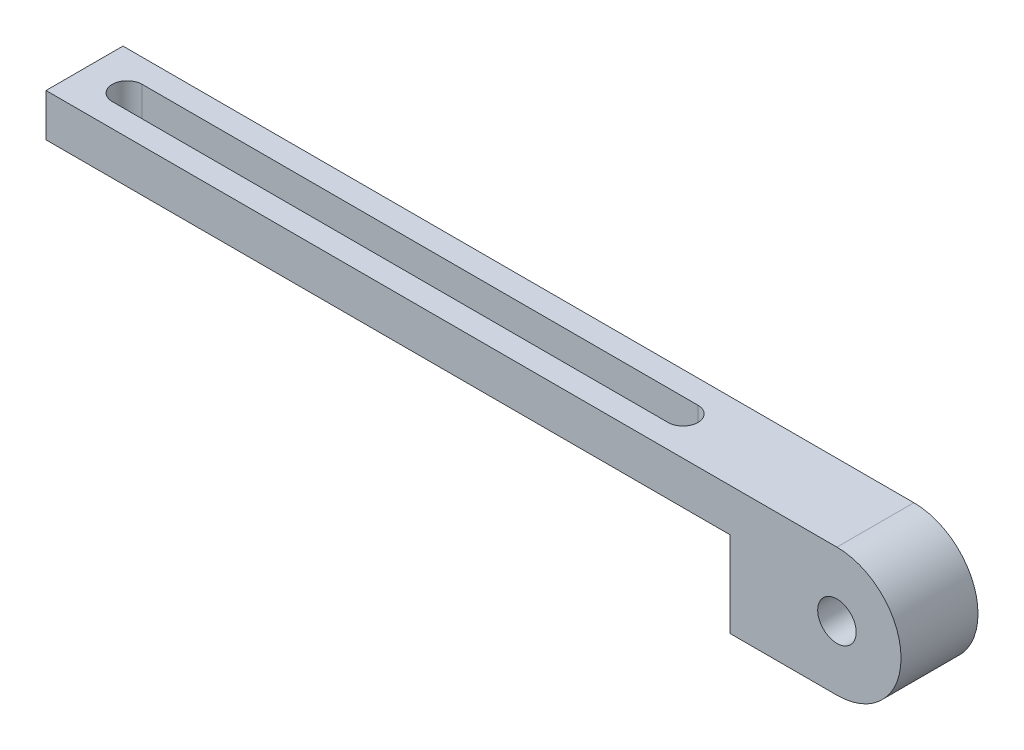
ISO-10303-21;
HEADER;
FILE_DESCRIPTION(('STEP AP214'),'2;1');
FILE_NAME('part.step','',(''),(''),'','','');
FILE_SCHEMA(('AUTOMOTIVE_DESIGN { 1 0 10303 214 1 1 1 1 }'));
ENDSEC;
DATA;
#1=APPLICATION_CONTEXT('core data for automotive mechanical design processes');
#2=APPLICATION_PROTOCOL_DEFINITION('international standard','automotive_design',2000,#1);
#3=PRODUCT_CONTEXT('',#1,'mechanical');
#4=PRODUCT('Part','Part','',(#3));
#5=PRODUCT_RELATED_PRODUCT_CATEGORY('part','',(#4));
#6=PRODUCT_DEFINITION_FORMATION('','',#4);
#7=PRODUCT_DEFINITION_CONTEXT('part definition',#1,'design');
#8=PRODUCT_DEFINITION('design','',#6,#7);
#9=PRODUCT_DEFINITION_SHAPE('','',#8);
#10=(LENGTH_UNIT() NAMED_UNIT(*) SI_UNIT(.MILLI.,.METRE.));
#11=(NAMED_UNIT(*) PLANE_ANGLE_UNIT() SI_UNIT($,.RADIAN.));
#12=(NAMED_UNIT(*) SI_UNIT($,.STERADIAN.) SOLID_ANGLE_UNIT());
#13=UNCERTAINTY_MEASURE_WITH_UNIT(LENGTH_MEASURE(1.E-05),#10,'distance_accuracy_value','');
#14=(GEOMETRIC_REPRESENTATION_CONTEXT(3) GLOBAL_UNCERTAINTY_ASSIGNED_CONTEXT((#13)) GLOBAL_UNIT_ASSIGNED_CONTEXT((#10,
#11,#12)) REPRESENTATION_CONTEXT('',''));
#15=CARTESIAN_POINT('',(0.,0.,0.));
#16=DIRECTION('',(0.,0.,1.));
#17=DIRECTION('',(1.,0.,0.));
#18=AXIS2_PLACEMENT_3D('',#15,#16,#17);
#19=CARTESIAN_POINT('',(0.,5.,0.));
#20=DIRECTION('',(0.,0.,-1.));
#21=DIRECTION('',(-1.,0.,0.));
#22=AXIS2_PLACEMENT_3D('',#19,#20,#21);
#23=PLANE('',#22);
#24=DIRECTION('',(1.,0.,0.));
#25=VECTOR('',#24,1.);
#26=CARTESIAN_POINT('',(100.,-10.,0.));
#27=LINE('',#26,#25);
#28=CARTESIAN_POINT('',(80.,-10.,0.));
#29=VERTEX_POINT('',#28);
#30=CARTESIAN_POINT('',(92.5,-10.,0.));
#31=VERTEX_POINT('',#30);
#32=EDGE_CURVE('E229',#29,#31,#27,.T.);
#33=ORIENTED_EDGE('',*,*,#32,.T.);
#34=CARTESIAN_POINT('',(92.5,-2.5,0.));
#35=DIRECTION('',(0.,0.,-1.));
#36=DIRECTION('',(-1.,0.,0.));
#37=AXIS2_PLACEMENT_3D('',#34,#35,#36);
#38=CIRCLE('',#37,7.5);
#39=CARTESIAN_POINT('',(92.5,5.,0.));
#40=VERTEX_POINT('',#39);
#41=EDGE_CURVE('E205',#31,#40,#38,.F.);
#42=ORIENTED_EDGE('',*,*,#41,.T.);
#43=DIRECTION('',(1.,0.,0.));
#44=VECTOR('',#43,1.);
#45=CARTESIAN_POINT('',(0.,5.,0.));
#46=LINE('',#45,#44);
#47=CARTESIAN_POINT('',(0.,5.,0.));
#48=VERTEX_POINT('',#47);
#49=EDGE_CURVE('E279',#48,#40,#46,.T.);
#50=ORIENTED_EDGE('',*,*,#49,.F.);
#51=DIRECTION('',(0.,-1.,0.));
#52=VECTOR('',#51,1.);
#53=CARTESIAN_POINT('',(0.,5.,0.));
#54=LINE('',#53,#52);
#55=CARTESIAN_POINT('',(0.,0.,0.));
#56=VERTEX_POINT('',#55);
#57=EDGE_CURVE('E299',#48,#56,#54,.T.);
#58=ORIENTED_EDGE('',*,*,#57,.T.);
#59=DIRECTION('',(1.,0.,0.));
#60=VECTOR('',#59,1.);
#61=CARTESIAN_POINT('',(0.,0.,0.));
#62=LINE('',#61,#60);
#63=CARTESIAN_POINT('',(80.,0.,0.));
#64=VERTEX_POINT('',#63);
#65=EDGE_CURVE('E290',#56,#64,#62,.T.);
#66=ORIENTED_EDGE('',*,*,#65,.T.);
#67=DIRECTION('',(0.,-1.,0.));
#68=VECTOR('',#67,1.);
#69=CARTESIAN_POINT('',(80.,5.,0.));
#70=LINE('',#69,#68);
#71=EDGE_CURVE('E225',#64,#29,#70,.T.);
#72=ORIENTED_EDGE('',*,*,#71,.T.);
#73=EDGE_LOOP('',(#33,#42,#50,#58,#66,#72));
#74=FACE_BOUND('',#73,.T.);
#75=CARTESIAN_POINT('',(92.5,-2.5,0.));
#76=DIRECTION('',(0.,0.,-1.));
#77=DIRECTION('',(-1.,0.,0.));
#78=AXIS2_PLACEMENT_3D('',#75,#76,#77);
#79=CIRCLE('',#78,2.25);
#80=CARTESIAN_POINT('',(90.25,-2.5,0.));
#81=VERTEX_POINT('',#80);
#82=EDGE_CURVE('E206',#81,#81,#79,.T.);
#83=ORIENTED_EDGE('',*,*,#82,.T.);
#84=EDGE_LOOP('',(#83));
#85=FACE_BOUND('',#84,.T.);
#86=ADVANCED_FACE('F119',(#74,#85),#23,.F.);
#87=CARTESIAN_POINT('',(0.,5.,-9.));
#88=DIRECTION('',(0.,0.,1.));
#89=DIRECTION('',(1.,0.,0.));
#90=AXIS2_PLACEMENT_3D('',#87,#88,#89);
#91=PLANE('',#90);
#92=CARTESIAN_POINT('',(92.5,-2.5,-9.));
#93=DIRECTION('',(0.,0.,-1.));
#94=DIRECTION('',(-1.,0.,0.));
#95=AXIS2_PLACEMENT_3D('',#92,#93,#94);
#96=CIRCLE('',#95,7.5);
#97=CARTESIAN_POINT('',(92.5,-10.,-9.));
#98=VERTEX_POINT('',#97);
#99=CARTESIAN_POINT('',(92.5,5.,-9.));
#100=VERTEX_POINT('',#99);
#101=EDGE_CURVE('E135',#98,#100,#96,.F.);
#102=ORIENTED_EDGE('',*,*,#101,.F.);
#103=DIRECTION('',(-1.,0.,0.));
#104=VECTOR('',#103,1.);
#105=CARTESIAN_POINT('',(100.,-10.,-9.));
#106=LINE('',#105,#104);
#107=CARTESIAN_POINT('',(80.,-10.,-9.));
#108=VERTEX_POINT('',#107);
#109=EDGE_CURVE('E200',#98,#108,#106,.T.);
#110=ORIENTED_EDGE('',*,*,#109,.T.);
#111=DIRECTION('',(0.,1.,0.));
#112=VECTOR('',#111,1.);
#113=CARTESIAN_POINT('',(80.,5.,-9.));
#114=LINE('',#113,#112);
#115=CARTESIAN_POINT('',(80.,0.,-9.));
#116=VERTEX_POINT('',#115);
#117=EDGE_CURVE('E218',#108,#116,#114,.T.);
#118=ORIENTED_EDGE('',*,*,#117,.T.);
#119=DIRECTION('',(-1.,0.,0.));
#120=VECTOR('',#119,1.);
#121=CARTESIAN_POINT('',(0.,0.,-9.));
#122=LINE('',#121,#120);
#123=CARTESIAN_POINT('',(0.,0.,-9.));
#124=VERTEX_POINT('',#123);
#125=EDGE_CURVE('E280',#116,#124,#122,.T.);
#126=ORIENTED_EDGE('',*,*,#125,.T.);
#127=DIRECTION('',(0.,-1.,0.));
#128=VECTOR('',#127,1.);
#129=CARTESIAN_POINT('',(0.,5.,-9.));
#130=LINE('',#129,#128);
#131=CARTESIAN_POINT('',(0.,5.,-9.));
#132=VERTEX_POINT('',#131);
#133=EDGE_CURVE('E286',#132,#124,#130,.T.);
#134=ORIENTED_EDGE('',*,*,#133,.F.);
#135=DIRECTION('',(-1.,0.,0.));
#136=VECTOR('',#135,1.);
#137=CARTESIAN_POINT('',(0.,5.,-9.));
#138=LINE('',#137,#136);
#139=EDGE_CURVE('E203',#100,#132,#138,.T.);
#140=ORIENTED_EDGE('',*,*,#139,.F.);
#141=EDGE_LOOP('',(#102,#110,#118,#126,#134,#140));
#142=FACE_BOUND('',#141,.T.);
#143=CARTESIAN_POINT('',(92.5,-2.5,-9.));
#144=DIRECTION('',(0.,0.,-1.));
#145=DIRECTION('',(-1.,0.,0.));
#146=AXIS2_PLACEMENT_3D('',#143,#144,#145);
#147=CIRCLE('',#146,2.25);
#148=CARTESIAN_POINT('',(90.25,-2.5,-9.));
#149=VERTEX_POINT('',#148);
#150=EDGE_CURVE('E393',#149,#149,#147,.T.);
#151=ORIENTED_EDGE('',*,*,#150,.F.);
#152=EDGE_LOOP('',(#151));
#153=FACE_BOUND('',#152,.T.);
#154=ADVANCED_FACE('F196',(#142,#153),#91,.F.);
#155=CARTESIAN_POINT('',(100.,-10.,25.));
#156=DIRECTION('',(0.,-1.,0.));
#157=DIRECTION('',(0.,0.,-1.));
#158=AXIS2_PLACEMENT_3D('',#155,#156,#157);
#159=PLANE('',#158);
#160=ORIENTED_EDGE('',*,*,#109,.F.);
#161=DIRECTION('',(0.,0.,-1.));
#162=VECTOR('',#161,1.);
#163=CARTESIAN_POINT('',(92.5,-10.,1.));
#164=LINE('',#163,#162);
#165=EDGE_CURVE('E12',#98,#31,#164,.F.);
#166=ORIENTED_EDGE('',*,*,#165,.T.);
#167=ORIENTED_EDGE('',*,*,#32,.F.);
#168=DIRECTION('',(0.,0.,-1.));
#169=VECTOR('',#168,1.);
#170=CARTESIAN_POINT('',(80.,-10.,25.));
#171=LINE('',#170,#169);
#172=EDGE_CURVE('E215',#29,#108,#171,.T.);
#173=ORIENTED_EDGE('',*,*,#172,.T.);
#174=EDGE_LOOP('',(#160,#166,#167,#173));
#175=FACE_BOUND('',#174,.T.);
#176=ADVANCED_FACE('F213',(#175),#159,.T.);
#177=CARTESIAN_POINT('',(0.,5.,0.));
#178=DIRECTION('',(0.,-1.,0.));
#179=DIRECTION('',(0.,0.,-1.));
#180=AXIS2_PLACEMENT_3D('',#177,#178,#179);
#181=PLANE('',#180);
#182=DIRECTION('',(1.,0.,0.));
#183=VECTOR('',#182,1.);
#184=CARTESIAN_POINT('',(5.,5.,-2.75));
#185=LINE('',#184,#183);
#186=CARTESIAN_POINT('',(5.,5.,-2.75));
#187=VERTEX_POINT('',#186);
#188=CARTESIAN_POINT('',(70.,5.,-2.75));
#189=VERTEX_POINT('',#188);
#190=EDGE_CURVE('E252',#187,#189,#185,.T.);
#191=ORIENTED_EDGE('',*,*,#190,.F.);
#192=CARTESIAN_POINT('',(5.,5.,-4.5));
#193=DIRECTION('',(0.,1.,0.));
#194=DIRECTION('',(0.,0.,1.));
#195=AXIS2_PLACEMENT_3D('',#192,#193,#194);
#196=CIRCLE('',#195,1.75);
#197=CARTESIAN_POINT('',(5.,5.,-6.25));
#198=VERTEX_POINT('',#197);
#199=EDGE_CURVE('E143',#198,#187,#196,.T.);
#200=ORIENTED_EDGE('',*,*,#199,.F.);
#201=DIRECTION('',(-1.,0.,0.));
#202=VECTOR('',#201,1.);
#203=CARTESIAN_POINT('',(5.,5.,-6.25));
#204=LINE('',#203,#202);
#205=CARTESIAN_POINT('',(70.,5.,-6.25));
#206=VERTEX_POINT('',#205);
#207=EDGE_CURVE('E237',#206,#198,#204,.T.);
#208=ORIENTED_EDGE('',*,*,#207,.F.);
#209=CARTESIAN_POINT('',(70.,5.,-4.5));
#210=DIRECTION('',(0.,1.,0.));
#211=DIRECTION('',(0.,0.,1.));
#212=AXIS2_PLACEMENT_3D('',#209,#210,#211);
#213=CIRCLE('',#212,1.75);
#214=EDGE_CURVE('E256',#189,#206,#213,.T.);
#215=ORIENTED_EDGE('',*,*,#214,.F.);
#216=EDGE_LOOP('',(#191,#200,#208,#215));
#217=FACE_BOUND('',#216,.T.);
#218=DIRECTION('',(0.,0.,-1.));
#219=VECTOR('',#218,1.);
#220=CARTESIAN_POINT('',(92.5,5.,1.));
#221=LINE('',#220,#219);
#222=EDGE_CURVE('E128',#100,#40,#221,.F.);
#223=ORIENTED_EDGE('',*,*,#222,.F.);
#224=ORIENTED_EDGE('',*,*,#139,.T.);
#225=DIRECTION('',(0.,0.,1.));
#226=VECTOR('',#225,1.);
#227=CARTESIAN_POINT('',(0.,5.,0.));
#228=LINE('',#227,#226);
#229=EDGE_CURVE('E275',#132,#48,#228,.T.);
#230=ORIENTED_EDGE('',*,*,#229,.T.);
#231=ORIENTED_EDGE('',*,*,#49,.T.);
#232=EDGE_LOOP('',(#223,#224,#230,#231));
#233=FACE_BOUND('',#232,.T.);
#234=ADVANCED_FACE('F309',(#217,#233),#181,.F.);
#235=CARTESIAN_POINT('',(0.,5.,0.));
#236=DIRECTION('',(1.,0.,0.));
#237=DIRECTION('',(0.,0.,-1.));
#238=AXIS2_PLACEMENT_3D('',#235,#236,#237);
#239=PLANE('',#238);
#240=DIRECTION('',(0.,0.,1.));
#241=VECTOR('',#240,1.);
#242=CARTESIAN_POINT('',(0.,0.,0.));
#243=LINE('',#242,#241);
#244=EDGE_CURVE('E266',#124,#56,#243,.T.);
#245=ORIENTED_EDGE('',*,*,#244,.T.);
#246=ORIENTED_EDGE('',*,*,#57,.F.);
#247=ORIENTED_EDGE('',*,*,#229,.F.);
#248=ORIENTED_EDGE('',*,*,#133,.T.);
#249=EDGE_LOOP('',(#245,#246,#247,#248));
#250=FACE_BOUND('',#249,.T.);
#251=ADVANCED_FACE('F121',(#250),#239,.F.);
#252=CARTESIAN_POINT('',(0.,0.,0.));
#253=DIRECTION('',(0.,-1.,0.));
#254=DIRECTION('',(0.,0.,-1.));
#255=AXIS2_PLACEMENT_3D('',#252,#253,#254);
#256=PLANE('',#255);
#257=DIRECTION('',(0.,0.,-1.));
#258=VECTOR('',#257,1.);
#259=CARTESIAN_POINT('',(80.,0.,0.));
#260=LINE('',#259,#258);
#261=EDGE_CURVE('E303',#64,#116,#260,.T.);
#262=ORIENTED_EDGE('',*,*,#261,.F.);
#263=ORIENTED_EDGE('',*,*,#65,.F.);
#264=ORIENTED_EDGE('',*,*,#244,.F.);
#265=ORIENTED_EDGE('',*,*,#125,.F.);
#266=EDGE_LOOP('',(#262,#263,#264,#265));
#267=FACE_BOUND('',#266,.T.);
#268=CARTESIAN_POINT('',(5.,0.,-4.5));
#269=DIRECTION('',(0.,1.,0.));
#270=DIRECTION('',(0.,0.,1.));
#271=AXIS2_PLACEMENT_3D('',#268,#269,#270);
#272=CIRCLE('',#271,1.75);
#273=CARTESIAN_POINT('',(5.,0.,-6.25));
#274=VERTEX_POINT('',#273);
#275=CARTESIAN_POINT('',(5.,0.,-2.75));
#276=VERTEX_POINT('',#275);
#277=EDGE_CURVE('E232',#274,#276,#272,.T.);
#278=ORIENTED_EDGE('',*,*,#277,.T.);
#279=DIRECTION('',(1.,0.,0.));
#280=VECTOR('',#279,1.);
#281=CARTESIAN_POINT('',(5.,0.,-2.75));
#282=LINE('',#281,#280);
#283=CARTESIAN_POINT('',(70.,0.,-2.75));
#284=VERTEX_POINT('',#283);
#285=EDGE_CURVE('E236',#276,#284,#282,.T.);
#286=ORIENTED_EDGE('',*,*,#285,.T.);
#287=CARTESIAN_POINT('',(70.,0.,-4.5));
#288=DIRECTION('',(0.,1.,0.));
#289=DIRECTION('',(0.,0.,1.));
#290=AXIS2_PLACEMENT_3D('',#287,#288,#289);
#291=CIRCLE('',#290,1.75);
#292=CARTESIAN_POINT('',(70.,0.,-6.25));
#293=VERTEX_POINT('',#292);
#294=EDGE_CURVE('E241',#284,#293,#291,.T.);
#295=ORIENTED_EDGE('',*,*,#294,.T.);
#296=DIRECTION('',(-1.,0.,0.));
#297=VECTOR('',#296,1.);
#298=CARTESIAN_POINT('',(5.,0.,-6.25));
#299=LINE('',#298,#297);
#300=EDGE_CURVE('E245',#293,#274,#299,.T.);
#301=ORIENTED_EDGE('',*,*,#300,.T.);
#302=EDGE_LOOP('',(#278,#286,#295,#301));
#303=FACE_BOUND('',#302,.T.);
#304=ADVANCED_FACE('F316',(#267,#303),#256,.T.);
#305=CARTESIAN_POINT('',(5.,0.,-4.5));
#306=DIRECTION('',(0.,1.,0.));
#307=DIRECTION('',(0.,0.,1.));
#308=AXIS2_PLACEMENT_3D('',#305,#306,#307);
#309=CYLINDRICAL_SURFACE('',#308,1.75);
#310=ORIENTED_EDGE('',*,*,#199,.T.);
#311=DIRECTION('',(0.,1.,0.));
#312=VECTOR('',#311,1.);
#313=CARTESIAN_POINT('',(5.,0.,-2.75));
#314=LINE('',#313,#312);
#315=EDGE_CURVE('E249',#276,#187,#314,.T.);
#316=ORIENTED_EDGE('',*,*,#315,.F.);
#317=ORIENTED_EDGE('',*,*,#277,.F.);
#318=DIRECTION('',(0.,1.,0.));
#319=VECTOR('',#318,1.);
#320=CARTESIAN_POINT('',(5.,0.,-6.25));
#321=LINE('',#320,#319);
#322=EDGE_CURVE('E263',#274,#198,#321,.T.);
#323=ORIENTED_EDGE('',*,*,#322,.T.);
#324=EDGE_LOOP('',(#310,#316,#317,#323));
#325=FACE_BOUND('',#324,.T.);
#326=ADVANCED_FACE('F344',(#325),#309,.F.);
#327=CARTESIAN_POINT('',(5.,0.,-6.25));
#328=DIRECTION('',(0.,0.,-1.));
#329=DIRECTION('',(-1.,0.,0.));
#330=AXIS2_PLACEMENT_3D('',#327,#328,#329);
#331=PLANE('',#330);
#332=ORIENTED_EDGE('',*,*,#207,.T.);
#333=ORIENTED_EDGE('',*,*,#322,.F.);
#334=ORIENTED_EDGE('',*,*,#300,.F.);
#335=DIRECTION('',(0.,1.,0.));
#336=VECTOR('',#335,1.);
#337=CARTESIAN_POINT('',(70.,0.,-6.25));
#338=LINE('',#337,#336);
#339=EDGE_CURVE('E267',#293,#206,#338,.T.);
#340=ORIENTED_EDGE('',*,*,#339,.T.);
#341=EDGE_LOOP('',(#332,#333,#334,#340));
#342=FACE_BOUND('',#341,.T.);
#343=ADVANCED_FACE('F349',(#342),#331,.F.);
#344=CARTESIAN_POINT('',(70.,0.,-4.5));
#345=DIRECTION('',(0.,1.,0.));
#346=DIRECTION('',(0.,0.,1.));
#347=AXIS2_PLACEMENT_3D('',#344,#345,#346);
#348=CYLINDRICAL_SURFACE('',#347,1.75);
#349=ORIENTED_EDGE('',*,*,#214,.T.);
#350=ORIENTED_EDGE('',*,*,#339,.F.);
#351=ORIENTED_EDGE('',*,*,#294,.F.);
#352=DIRECTION('',(0.,1.,0.));
#353=VECTOR('',#352,1.);
#354=CARTESIAN_POINT('',(70.,0.,-2.75));
#355=LINE('',#354,#353);
#356=EDGE_CURVE('E270',#284,#189,#355,.T.);
#357=ORIENTED_EDGE('',*,*,#356,.T.);
#358=EDGE_LOOP('',(#349,#350,#351,#357));
#359=FACE_BOUND('',#358,.T.);
#360=ADVANCED_FACE('F332',(#359),#348,.F.);
#361=CARTESIAN_POINT('',(5.,0.,-2.75));
#362=DIRECTION('',(0.,0.,1.));
#363=DIRECTION('',(1.,0.,0.));
#364=AXIS2_PLACEMENT_3D('',#361,#362,#363);
#365=PLANE('',#364);
#366=ORIENTED_EDGE('',*,*,#190,.T.);
#367=ORIENTED_EDGE('',*,*,#356,.F.);
#368=ORIENTED_EDGE('',*,*,#285,.F.);
#369=ORIENTED_EDGE('',*,*,#315,.T.);
#370=EDGE_LOOP('',(#366,#367,#368,#369));
#371=FACE_BOUND('',#370,.T.);
#372=ADVANCED_FACE('F323',(#371),#365,.F.);
#373=CARTESIAN_POINT('',(80.,5.,25.));
#374=DIRECTION('',(-1.,0.,0.));
#375=DIRECTION('',(0.,0.,1.));
#376=AXIS2_PLACEMENT_3D('',#373,#374,#375);
#377=PLANE('',#376);
#378=ORIENTED_EDGE('',*,*,#71,.F.);
#379=ORIENTED_EDGE('',*,*,#261,.T.);
#380=ORIENTED_EDGE('',*,*,#117,.F.);
#381=ORIENTED_EDGE('',*,*,#172,.F.);
#382=EDGE_LOOP('',(#378,#379,#380,#381));
#383=FACE_BOUND('',#382,.T.);
#384=ADVANCED_FACE('F320',(#383),#377,.T.);
#385=CARTESIAN_POINT('',(92.5,-2.5,1.));
#386=DIRECTION('',(0.,0.,-1.));
#387=DIRECTION('',(-1.,0.,0.));
#388=AXIS2_PLACEMENT_3D('',#385,#386,#387);
#389=CYLINDRICAL_SURFACE('',#388,7.5);
#390=ORIENTED_EDGE('',*,*,#41,.F.);
#391=ORIENTED_EDGE('',*,*,#165,.F.);
#392=ORIENTED_EDGE('',*,*,#101,.T.);
#393=ORIENTED_EDGE('',*,*,#222,.T.);
#394=EDGE_LOOP('',(#390,#391,#392,#393));
#395=FACE_BOUND('',#394,.T.);
#396=ADVANCED_FACE('F208',(#395),#389,.T.);
#397=CARTESIAN_POINT('',(92.5,-2.5,1.));
#398=DIRECTION('',(0.,0.,-1.));
#399=DIRECTION('',(-1.,0.,0.));
#400=AXIS2_PLACEMENT_3D('',#397,#398,#399);
#401=CYLINDRICAL_SURFACE('',#400,2.25);
#402=ORIENTED_EDGE('',*,*,#150,.T.);
#403=EDGE_LOOP('',(#402));
#404=FACE_BOUND('',#403,.T.);
#405=ORIENTED_EDGE('',*,*,#82,.F.);
#406=EDGE_LOOP('',(#405));
#407=FACE_BOUND('',#406,.T.);
#408=ADVANCED_FACE('F330',(#404,#407),#401,.F.);
#409=CLOSED_SHELL('',(#86,#154,#176,#234,#251,#304,#326,#343,#360,#372,#384,#396,#408));
#410=MANIFOLD_SOLID_BREP('B2',#409);
#411=ADVANCED_BREP_SHAPE_REPRESENTATION('',(#18,#410),#14);
#412=SHAPE_DEFINITION_REPRESENTATION(#9,#411);
ENDSEC;
END-ISO-10303-21;
